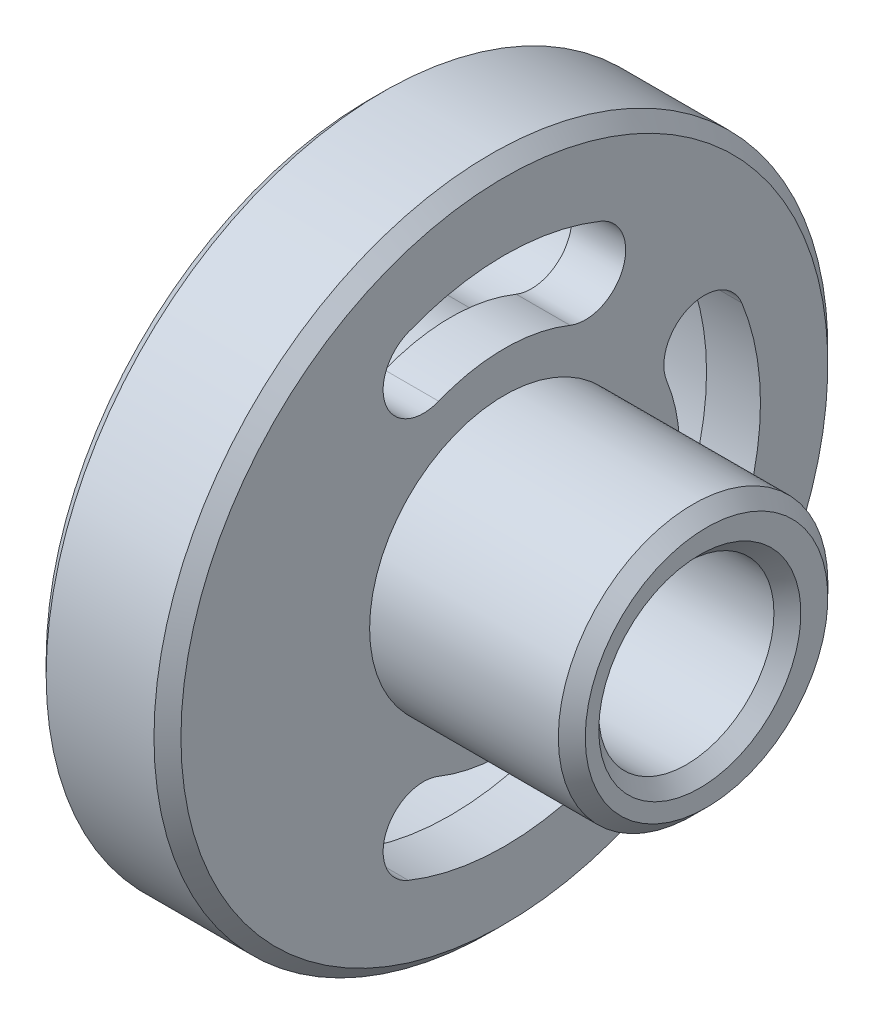
ISO-10303-21;
HEADER;
FILE_DESCRIPTION(('STEP AP214'),'2;1');
FILE_NAME('part.step','',(''),(''),'','','');
FILE_SCHEMA(('AUTOMOTIVE_DESIGN { 1 0 10303 214 1 1 1 1 }'));
ENDSEC;
DATA;
#1=APPLICATION_CONTEXT('core data for automotive mechanical design processes');
#2=APPLICATION_PROTOCOL_DEFINITION('international standard','automotive_design',2000,#1);
#3=PRODUCT_CONTEXT('',#1,'mechanical');
#4=PRODUCT('Part','Part','',(#3));
#5=PRODUCT_RELATED_PRODUCT_CATEGORY('part','',(#4));
#6=PRODUCT_DEFINITION_FORMATION('','',#4);
#7=PRODUCT_DEFINITION_CONTEXT('part definition',#1,'design');
#8=PRODUCT_DEFINITION('design','',#6,#7);
#9=PRODUCT_DEFINITION_SHAPE('','',#8);
#10=(LENGTH_UNIT() NAMED_UNIT(*) SI_UNIT(.MILLI.,.METRE.));
#11=(NAMED_UNIT(*) PLANE_ANGLE_UNIT() SI_UNIT($,.RADIAN.));
#12=(NAMED_UNIT(*) SI_UNIT($,.STERADIAN.) SOLID_ANGLE_UNIT());
#13=UNCERTAINTY_MEASURE_WITH_UNIT(LENGTH_MEASURE(1.E-05),#10,'distance_accuracy_value','');
#14=(GEOMETRIC_REPRESENTATION_CONTEXT(3) GLOBAL_UNCERTAINTY_ASSIGNED_CONTEXT((#13)) GLOBAL_UNIT_ASSIGNED_CONTEXT((#10,
#11,#12)) REPRESENTATION_CONTEXT('',''));
#15=CARTESIAN_POINT('',(0.,0.,0.));
#16=DIRECTION('',(0.,0.,1.));
#17=DIRECTION('',(1.,0.,0.));
#18=AXIS2_PLACEMENT_3D('',#15,#16,#17);
#19=CARTESIAN_POINT('',(0.,0.,0.));
#20=DIRECTION('',(1.,0.,0.));
#21=DIRECTION('',(0.,0.,-1.));
#22=AXIS2_PLACEMENT_3D('',#19,#20,#21);
#23=PLANE('',#22);
#24=CARTESIAN_POINT('',(0.,-6.00000000000006,-14.8323969741913));
#25=DIRECTION('',(-1.,0.,0.));
#26=DIRECTION('',(0.,0.,1.));
#27=AXIS2_PLACEMENT_3D('',#24,#25,#26);
#28=CIRCLE('',#27,5.);
#29=CARTESIAN_POINT('',(0.,-7.87500000000007,-19.4675210286261));
#30=VERTEX_POINT('',#29);
#31=CARTESIAN_POINT('',(0.,-4.12500000000004,-10.1972729197565));
#32=VERTEX_POINT('',#31);
#33=EDGE_CURVE('E343',#30,#32,#28,.T.);
#34=ORIENTED_EDGE('',*,*,#33,.F.);
#35=CARTESIAN_POINT('',(0.,0.,0.));
#36=DIRECTION('',(-1.,0.,0.));
#37=DIRECTION('',(0.,0.,1.));
#38=AXIS2_PLACEMENT_3D('',#35,#36,#37);
#39=CIRCLE('',#38,21.);
#40=CARTESIAN_POINT('',(0.,7.87499999999992,-19.4675210286261));
#41=VERTEX_POINT('',#40);
#42=EDGE_CURVE('E347',#41,#30,#39,.T.);
#43=ORIENTED_EDGE('',*,*,#42,.F.);
#44=CARTESIAN_POINT('',(0.,5.99999999999994,-14.8323969741913));
#45=DIRECTION('',(-1.,0.,0.));
#46=DIRECTION('',(0.,0.,1.));
#47=AXIS2_PLACEMENT_3D('',#44,#45,#46);
#48=CIRCLE('',#47,5.);
#49=CARTESIAN_POINT('',(0.,4.12499999999996,-10.1972729197565));
#50=VERTEX_POINT('',#49);
#51=EDGE_CURVE('E334',#50,#41,#48,.T.);
#52=ORIENTED_EDGE('',*,*,#51,.F.);
#53=CARTESIAN_POINT('',(0.,0.,0.));
#54=DIRECTION('',(1.,0.,0.));
#55=DIRECTION('',(0.,0.,1.));
#56=AXIS2_PLACEMENT_3D('',#53,#54,#55);
#57=CIRCLE('',#56,11.);
#58=EDGE_CURVE('E338',#32,#50,#57,.T.);
#59=ORIENTED_EDGE('',*,*,#58,.F.);
#60=EDGE_LOOP('',(#34,#43,#52,#59));
#61=FACE_BOUND('',#60,.T.);
#62=CARTESIAN_POINT('',(0.,-14.8323969741913,6.00000000000011));
#63=DIRECTION('',(-1.,0.,0.));
#64=DIRECTION('',(0.,0.,1.));
#65=AXIS2_PLACEMENT_3D('',#62,#63,#64);
#66=CIRCLE('',#65,5.);
#67=CARTESIAN_POINT('',(0.,-19.4675210286261,7.87500000000014));
#68=VERTEX_POINT('',#67);
#69=CARTESIAN_POINT('',(0.,-10.1972729197565,4.12500000000007));
#70=VERTEX_POINT('',#69);
#71=EDGE_CURVE('E299',#68,#70,#66,.T.);
#72=ORIENTED_EDGE('',*,*,#71,.F.);
#73=CARTESIAN_POINT('',(0.,0.,0.));
#74=DIRECTION('',(-1.,0.,0.));
#75=DIRECTION('',(0.,0.,1.));
#76=AXIS2_PLACEMENT_3D('',#73,#74,#75);
#77=CIRCLE('',#76,21.);
#78=CARTESIAN_POINT('',(0.,-19.4675210286262,-7.87499999999986));
#79=VERTEX_POINT('',#78);
#80=EDGE_CURVE('E303',#79,#68,#77,.T.);
#81=ORIENTED_EDGE('',*,*,#80,.F.);
#82=CARTESIAN_POINT('',(0.,-14.8323969741914,-5.99999999999989));
#83=DIRECTION('',(-1.,0.,0.));
#84=DIRECTION('',(0.,0.,1.));
#85=AXIS2_PLACEMENT_3D('',#82,#83,#84);
#86=CIRCLE('',#85,5.);
#87=CARTESIAN_POINT('',(0.,-10.1972729197566,-4.12499999999993));
#88=VERTEX_POINT('',#87);
#89=EDGE_CURVE('E290',#88,#79,#86,.T.);
#90=ORIENTED_EDGE('',*,*,#89,.F.);
#91=CARTESIAN_POINT('',(0.,0.,0.));
#92=DIRECTION('',(1.,0.,0.));
#93=DIRECTION('',(0.,0.,1.));
#94=AXIS2_PLACEMENT_3D('',#91,#92,#93);
#95=CIRCLE('',#94,11.);
#96=EDGE_CURVE('E294',#70,#88,#95,.T.);
#97=ORIENTED_EDGE('',*,*,#96,.F.);
#98=EDGE_LOOP('',(#72,#81,#90,#97));
#99=FACE_BOUND('',#98,.T.);
#100=CARTESIAN_POINT('',(0.,0.,0.));
#101=DIRECTION('',(-1.,0.,0.));
#102=DIRECTION('',(0.,0.,1.));
#103=AXIS2_PLACEMENT_3D('',#100,#101,#102);
#104=CIRCLE('',#103,21.);
#105=CARTESIAN_POINT('',(0.,19.4675210286261,7.875));
#106=VERTEX_POINT('',#105);
#107=CARTESIAN_POINT('',(0.,19.4675210286261,-7.875));
#108=VERTEX_POINT('',#107);
#109=EDGE_CURVE('E385',#106,#108,#104,.T.);
#110=ORIENTED_EDGE('',*,*,#109,.F.);
#111=CARTESIAN_POINT('',(0.,14.8323969741913,6.));
#112=DIRECTION('',(-1.,0.,0.));
#113=DIRECTION('',(0.,0.,1.));
#114=AXIS2_PLACEMENT_3D('',#111,#112,#113);
#115=CIRCLE('',#114,5.);
#116=CARTESIAN_POINT('',(0.,10.1972729197565,4.125));
#117=VERTEX_POINT('',#116);
#118=EDGE_CURVE('E350',#117,#106,#115,.T.);
#119=ORIENTED_EDGE('',*,*,#118,.F.);
#120=CARTESIAN_POINT('',(0.,0.,0.));
#121=DIRECTION('',(1.,0.,0.));
#122=DIRECTION('',(0.,0.,1.));
#123=AXIS2_PLACEMENT_3D('',#120,#121,#122);
#124=CIRCLE('',#123,11.);
#125=CARTESIAN_POINT('',(0.,10.1972729197565,-4.125));
#126=VERTEX_POINT('',#125);
#127=EDGE_CURVE('E370',#126,#117,#124,.T.);
#128=ORIENTED_EDGE('',*,*,#127,.F.);
#129=CARTESIAN_POINT('',(0.,14.8323969741913,-6.));
#130=DIRECTION('',(-1.,0.,0.));
#131=DIRECTION('',(0.,0.,1.));
#132=AXIS2_PLACEMENT_3D('',#129,#130,#131);
#133=CIRCLE('',#132,5.);
#134=EDGE_CURVE('E389',#108,#126,#133,.T.);
#135=ORIENTED_EDGE('',*,*,#134,.F.);
#136=EDGE_LOOP('',(#110,#119,#128,#135));
#137=FACE_BOUND('',#136,.T.);
#138=CARTESIAN_POINT('',(0.,0.,0.));
#139=DIRECTION('',(-1.,0.,0.));
#140=DIRECTION('',(0.,0.,1.));
#141=AXIS2_PLACEMENT_3D('',#138,#139,#140);
#142=CIRCLE('',#141,24.);
#143=CARTESIAN_POINT('',(0.,0.,24.));
#144=VERTEX_POINT('',#143);
#145=EDGE_CURVE('E432',#144,#144,#142,.T.);
#146=ORIENTED_EDGE('',*,*,#145,.T.);
#147=EDGE_LOOP('',(#146));
#148=FACE_BOUND('',#147,.T.);
#149=ADVANCED_FACE('F50',(#61,#99,#137,#148),#23,.F.);
#150=CARTESIAN_POINT('',(1.,0.,0.));
#151=DIRECTION('',(1.,0.,0.));
#152=DIRECTION('',(0.,0.,-1.));
#153=AXIS2_PLACEMENT_3D('',#150,#151,#152);
#154=CONICAL_SURFACE('',#153,25.,0.785398163397449);
#155=ORIENTED_EDGE('',*,*,#145,.F.);
#156=EDGE_LOOP('',(#155));
#157=FACE_BOUND('',#156,.T.);
#158=CARTESIAN_POINT('',(1.,0.,0.));
#159=DIRECTION('',(-1.,0.,0.));
#160=DIRECTION('',(0.,0.,1.));
#161=AXIS2_PLACEMENT_3D('',#158,#159,#160);
#162=CIRCLE('',#161,25.);
#163=CARTESIAN_POINT('',(1.,0.,25.));
#164=VERTEX_POINT('',#163);
#165=EDGE_CURVE('E428',#164,#164,#162,.T.);
#166=ORIENTED_EDGE('',*,*,#165,.T.);
#167=EDGE_LOOP('',(#166));
#168=FACE_BOUND('',#167,.T.);
#169=ADVANCED_FACE('F490',(#157,#168),#154,.T.);
#170=CARTESIAN_POINT('',(0.,0.,0.));
#171=DIRECTION('',(-1.,0.,0.));
#172=DIRECTION('',(0.,0.,1.));
#173=AXIS2_PLACEMENT_3D('',#170,#171,#172);
#174=CYLINDRICAL_SURFACE('',#173,25.);
#175=ORIENTED_EDGE('',*,*,#165,.F.);
#176=EDGE_LOOP('',(#175));
#177=FACE_BOUND('',#176,.T.);
#178=CARTESIAN_POINT('',(9.,0.,0.));
#179=DIRECTION('',(-1.,0.,0.));
#180=DIRECTION('',(0.,0.,1.));
#181=AXIS2_PLACEMENT_3D('',#178,#179,#180);
#182=CIRCLE('',#181,25.);
#183=CARTESIAN_POINT('',(9.,0.,25.));
#184=VERTEX_POINT('',#183);
#185=EDGE_CURVE('E424',#184,#184,#182,.T.);
#186=ORIENTED_EDGE('',*,*,#185,.T.);
#187=EDGE_LOOP('',(#186));
#188=FACE_BOUND('',#187,.T.);
#189=ADVANCED_FACE('F497',(#177,#188),#174,.T.);
#190=CARTESIAN_POINT('',(10.,0.,0.));
#191=DIRECTION('',(-1.,0.,0.));
#192=DIRECTION('',(0.,0.,1.));
#193=AXIS2_PLACEMENT_3D('',#190,#191,#192);
#194=CONICAL_SURFACE('',#193,24.,0.785398163397449);
#195=ORIENTED_EDGE('',*,*,#185,.F.);
#196=EDGE_LOOP('',(#195));
#197=FACE_BOUND('',#196,.T.);
#198=CARTESIAN_POINT('',(10.,0.,0.));
#199=DIRECTION('',(-1.,0.,0.));
#200=DIRECTION('',(0.,0.,1.));
#201=AXIS2_PLACEMENT_3D('',#198,#199,#200);
#202=CIRCLE('',#201,24.);
#203=CARTESIAN_POINT('',(10.,0.,24.));
#204=VERTEX_POINT('',#203);
#205=EDGE_CURVE('E420',#204,#204,#202,.T.);
#206=ORIENTED_EDGE('',*,*,#205,.T.);
#207=EDGE_LOOP('',(#206));
#208=FACE_BOUND('',#207,.T.);
#209=ADVANCED_FACE('F505',(#197,#208),#194,.T.);
#210=CARTESIAN_POINT('',(10.,24.,0.));
#211=DIRECTION('',(-1.,0.,0.));
#212=DIRECTION('',(0.,0.,1.));
#213=AXIS2_PLACEMENT_3D('',#210,#211,#212);
#214=PLANE('',#213);
#215=CARTESIAN_POINT('',(10.,0.,0.));
#216=DIRECTION('',(-1.,0.,0.));
#217=DIRECTION('',(0.,0.,1.));
#218=AXIS2_PLACEMENT_3D('',#215,#216,#217);
#219=CIRCLE('',#218,13.);
#220=CARTESIAN_POINT('',(10.,12.0513225415304,-4.875));
#221=VERTEX_POINT('',#220);
#222=CARTESIAN_POINT('',(10.,12.0513225415305,4.875));
#223=VERTEX_POINT('',#222);
#224=EDGE_CURVE('E268',#221,#223,#219,.F.);
#225=ORIENTED_EDGE('',*,*,#224,.T.);
#226=CARTESIAN_POINT('',(10.,14.8323969741913,5.99999999999999));
#227=DIRECTION('',(-1.,0.,0.));
#228=DIRECTION('',(0.,0.,1.));
#229=AXIS2_PLACEMENT_3D('',#226,#227,#228);
#230=CIRCLE('',#229,3.);
#231=CARTESIAN_POINT('',(10.,17.6134714068522,7.125));
#232=VERTEX_POINT('',#231);
#233=EDGE_CURVE('E272',#223,#232,#230,.T.);
#234=ORIENTED_EDGE('',*,*,#233,.T.);
#235=CARTESIAN_POINT('',(10.,0.,0.));
#236=DIRECTION('',(-1.,0.,0.));
#237=DIRECTION('',(0.,0.,1.));
#238=AXIS2_PLACEMENT_3D('',#235,#236,#237);
#239=CIRCLE('',#238,19.);
#240=CARTESIAN_POINT('',(10.,17.6134714068522,-7.125));
#241=VERTEX_POINT('',#240);
#242=EDGE_CURVE('E260',#232,#241,#239,.T.);
#243=ORIENTED_EDGE('',*,*,#242,.T.);
#244=CARTESIAN_POINT('',(10.,14.8323969741913,-6.));
#245=DIRECTION('',(-1.,0.,0.));
#246=DIRECTION('',(0.,0.,1.));
#247=AXIS2_PLACEMENT_3D('',#244,#245,#246);
#248=CIRCLE('',#247,3.);
#249=EDGE_CURVE('E264',#241,#221,#248,.T.);
#250=ORIENTED_EDGE('',*,*,#249,.T.);
#251=EDGE_LOOP('',(#225,#234,#243,#250));
#252=FACE_BOUND('',#251,.T.);
#253=CARTESIAN_POINT('',(10.,6.00000000000054,-14.8323969741911));
#254=DIRECTION('',(-1.,0.,0.));
#255=DIRECTION('',(0.,0.,1.));
#256=AXIS2_PLACEMENT_3D('',#253,#254,#255);
#257=CIRCLE('',#256,3.);
#258=CARTESIAN_POINT('',(10.,4.87500000000044,-12.0513225415303));
#259=VERTEX_POINT('',#258);
#260=CARTESIAN_POINT('',(10.,7.12500000000065,-17.6134714068519));
#261=VERTEX_POINT('',#260);
#262=EDGE_CURVE('E237',#259,#261,#257,.T.);
#263=ORIENTED_EDGE('',*,*,#262,.T.);
#264=CARTESIAN_POINT('',(10.,0.,0.));
#265=DIRECTION('',(-1.,0.,0.));
#266=DIRECTION('',(0.,0.,1.));
#267=AXIS2_PLACEMENT_3D('',#264,#265,#266);
#268=CIRCLE('',#267,19.);
#269=CARTESIAN_POINT('',(10.,-7.12499999999935,-17.6134714068525));
#270=VERTEX_POINT('',#269);
#271=EDGE_CURVE('E226',#261,#270,#268,.T.);
#272=ORIENTED_EDGE('',*,*,#271,.T.);
#273=CARTESIAN_POINT('',(10.,-5.99999999999946,-14.8323969741915));
#274=DIRECTION('',(-1.,0.,0.));
#275=DIRECTION('',(0.,0.,1.));
#276=AXIS2_PLACEMENT_3D('',#273,#274,#275);
#277=CIRCLE('',#276,3.);
#278=CARTESIAN_POINT('',(10.,-4.87499999999955,-12.0513225415306));
#279=VERTEX_POINT('',#278);
#280=EDGE_CURVE('E211',#270,#279,#277,.T.);
#281=ORIENTED_EDGE('',*,*,#280,.T.);
#282=CARTESIAN_POINT('',(10.,0.,0.));
#283=DIRECTION('',(-1.,0.,0.));
#284=DIRECTION('',(0.,0.,1.));
#285=AXIS2_PLACEMENT_3D('',#282,#283,#284);
#286=CIRCLE('',#285,13.);
#287=EDGE_CURVE('E220',#279,#259,#286,.F.);
#288=ORIENTED_EDGE('',*,*,#287,.T.);
#289=EDGE_LOOP('',(#263,#272,#281,#288));
#290=FACE_BOUND('',#289,.T.);
#291=CARTESIAN_POINT('',(10.,-14.8323969741909,-6.00000000000109));
#292=DIRECTION('',(-1.,0.,0.));
#293=DIRECTION('',(0.,0.,1.));
#294=AXIS2_PLACEMENT_3D('',#291,#292,#293);
#295=CIRCLE('',#294,3.);
#296=CARTESIAN_POINT('',(10.,-12.0513225415301,-4.87500000000089));
#297=VERTEX_POINT('',#296);
#298=CARTESIAN_POINT('',(10.,-17.6134714068517,-7.1250000000013));
#299=VERTEX_POINT('',#298);
#300=EDGE_CURVE('E252',#297,#299,#295,.T.);
#301=ORIENTED_EDGE('',*,*,#300,.T.);
#302=CARTESIAN_POINT('',(10.,0.,0.));
#303=DIRECTION('',(-1.,0.,0.));
#304=DIRECTION('',(0.,0.,1.));
#305=AXIS2_PLACEMENT_3D('',#302,#303,#304);
#306=CIRCLE('',#305,19.);
#307=CARTESIAN_POINT('',(10.,-17.6134714068527,7.1249999999987));
#308=VERTEX_POINT('',#307);
#309=EDGE_CURVE('E256',#299,#308,#306,.T.);
#310=ORIENTED_EDGE('',*,*,#309,.T.);
#311=CARTESIAN_POINT('',(10.,-14.8323969741918,5.99999999999891));
#312=DIRECTION('',(-1.,0.,0.));
#313=DIRECTION('',(0.,0.,1.));
#314=AXIS2_PLACEMENT_3D('',#311,#312,#313);
#315=CIRCLE('',#314,3.);
#316=CARTESIAN_POINT('',(10.,-12.0513225415308,4.87499999999911));
#317=VERTEX_POINT('',#316);
#318=EDGE_CURVE('E239',#308,#317,#315,.T.);
#319=ORIENTED_EDGE('',*,*,#318,.T.);
#320=CARTESIAN_POINT('',(10.,0.,0.));
#321=DIRECTION('',(-1.,0.,0.));
#322=DIRECTION('',(0.,0.,1.));
#323=AXIS2_PLACEMENT_3D('',#320,#321,#322);
#324=CIRCLE('',#323,13.);
#325=EDGE_CURVE('E244',#317,#297,#324,.F.);
#326=ORIENTED_EDGE('',*,*,#325,.T.);
#327=EDGE_LOOP('',(#301,#310,#319,#326));
#328=FACE_BOUND('',#327,.T.);
#329=ORIENTED_EDGE('',*,*,#205,.F.);
#330=EDGE_LOOP('',(#329));
#331=FACE_BOUND('',#330,.T.);
#332=CARTESIAN_POINT('',(10.,0.,0.));
#333=DIRECTION('',(-1.,0.,0.));
#334=DIRECTION('',(0.,0.,1.));
#335=AXIS2_PLACEMENT_3D('',#332,#333,#334);
#336=CIRCLE('',#335,10.);
#337=CARTESIAN_POINT('',(10.,0.,10.));
#338=VERTEX_POINT('',#337);
#339=EDGE_CURVE('E416',#338,#338,#336,.T.);
#340=ORIENTED_EDGE('',*,*,#339,.T.);
#341=EDGE_LOOP('',(#340));
#342=FACE_BOUND('',#341,.T.);
#343=ADVANCED_FACE('F235',(#252,#290,#328,#331,#342),#214,.F.);
#344=CARTESIAN_POINT('',(0.,0.,0.));
#345=DIRECTION('',(-1.,0.,0.));
#346=DIRECTION('',(0.,0.,1.));
#347=AXIS2_PLACEMENT_3D('',#344,#345,#346);
#348=CYLINDRICAL_SURFACE('',#347,10.);
#349=ORIENTED_EDGE('',*,*,#339,.F.);
#350=EDGE_LOOP('',(#349));
#351=FACE_BOUND('',#350,.T.);
#352=CARTESIAN_POINT('',(24.,0.,0.));
#353=DIRECTION('',(-1.,0.,0.));
#354=DIRECTION('',(0.,0.,1.));
#355=AXIS2_PLACEMENT_3D('',#352,#353,#354);
#356=CIRCLE('',#355,10.);
#357=CARTESIAN_POINT('',(24.,0.,10.));
#358=VERTEX_POINT('',#357);
#359=EDGE_CURVE('E412',#358,#358,#356,.T.);
#360=ORIENTED_EDGE('',*,*,#359,.T.);
#361=EDGE_LOOP('',(#360));
#362=FACE_BOUND('',#361,.T.);
#363=ADVANCED_FACE('F512',(#351,#362),#348,.T.);
#364=CARTESIAN_POINT('',(25.,0.,0.));
#365=DIRECTION('',(-1.,0.,0.));
#366=DIRECTION('',(0.,0.,1.));
#367=AXIS2_PLACEMENT_3D('',#364,#365,#366);
#368=CONICAL_SURFACE('',#367,9.,0.785398163397447);
#369=ORIENTED_EDGE('',*,*,#359,.F.);
#370=EDGE_LOOP('',(#369));
#371=FACE_BOUND('',#370,.T.);
#372=CARTESIAN_POINT('',(25.,0.,0.));
#373=DIRECTION('',(-1.,0.,0.));
#374=DIRECTION('',(0.,0.,1.));
#375=AXIS2_PLACEMENT_3D('',#372,#373,#374);
#376=CIRCLE('',#375,9.);
#377=CARTESIAN_POINT('',(25.,0.,9.));
#378=VERTEX_POINT('',#377);
#379=EDGE_CURVE('E399',#378,#378,#376,.T.);
#380=ORIENTED_EDGE('',*,*,#379,.T.);
#381=EDGE_LOOP('',(#380));
#382=FACE_BOUND('',#381,.T.);
#383=ADVANCED_FACE('F516',(#371,#382),#368,.T.);
#384=CARTESIAN_POINT('',(25.,9.,0.));
#385=DIRECTION('',(-1.,0.,0.));
#386=DIRECTION('',(0.,0.,1.));
#387=AXIS2_PLACEMENT_3D('',#384,#385,#386);
#388=PLANE('',#387);
#389=CARTESIAN_POINT('',(25.,0.,0.5));
#390=DIRECTION('',(-1.,0.,0.));
#391=DIRECTION('',(0.,0.,1.));
#392=AXIS2_PLACEMENT_3D('',#389,#390,#391);
#393=CIRCLE('',#392,7.50000000000001);
#394=CARTESIAN_POINT('',(25.,0.,8.00000000000001));
#395=VERTEX_POINT('',#394);
#396=EDGE_CURVE('E11',#395,#395,#393,.T.);
#397=ORIENTED_EDGE('',*,*,#396,.T.);
#398=EDGE_LOOP('',(#397));
#399=FACE_BOUND('',#398,.T.);
#400=ORIENTED_EDGE('',*,*,#379,.F.);
#401=EDGE_LOOP('',(#400));
#402=FACE_BOUND('',#401,.T.);
#403=ADVANCED_FACE('F519',(#399,#402),#388,.F.);
#404=CARTESIAN_POINT('',(6.,14.8323969741913,6.));
#405=DIRECTION('',(-1.,0.,0.));
#406=DIRECTION('',(0.,0.,1.));
#407=AXIS2_PLACEMENT_3D('',#404,#405,#406);
#408=CYLINDRICAL_SURFACE('',#407,5.);
#409=ORIENTED_EDGE('',*,*,#118,.T.);
#410=DIRECTION('',(-1.,0.,0.));
#411=VECTOR('',#410,1.);
#412=CARTESIAN_POINT('',(6.,19.4675210286261,7.875));
#413=LINE('',#412,#411);
#414=CARTESIAN_POINT('',(6.,19.4675210286261,7.875));
#415=VERTEX_POINT('',#414);
#416=EDGE_CURVE('E382',#415,#106,#413,.T.);
#417=ORIENTED_EDGE('',*,*,#416,.F.);
#418=CARTESIAN_POINT('',(6.,14.8323969741913,6.));
#419=DIRECTION('',(-1.,0.,0.));
#420=DIRECTION('',(0.,0.,1.));
#421=AXIS2_PLACEMENT_3D('',#418,#419,#420);
#422=CIRCLE('',#421,5.);
#423=CARTESIAN_POINT('',(6.,10.1972729197565,4.125));
#424=VERTEX_POINT('',#423);
#425=EDGE_CURVE('E365',#424,#415,#422,.T.);
#426=ORIENTED_EDGE('',*,*,#425,.F.);
#427=DIRECTION('',(-1.,0.,0.));
#428=VECTOR('',#427,1.);
#429=CARTESIAN_POINT('',(6.,10.1972729197565,4.125));
#430=LINE('',#429,#428);
#431=EDGE_CURVE('E396',#424,#117,#430,.T.);
#432=ORIENTED_EDGE('',*,*,#431,.T.);
#433=EDGE_LOOP('',(#409,#417,#426,#432));
#434=FACE_BOUND('',#433,.T.);
#435=ADVANCED_FACE('F523',(#434),#408,.F.);
#436=CARTESIAN_POINT('',(6.,0.,0.));
#437=DIRECTION('',(-1.,0.,0.));
#438=DIRECTION('',(0.,0.,1.));
#439=AXIS2_PLACEMENT_3D('',#436,#437,#438);
#440=CYLINDRICAL_SURFACE('',#439,11.);
#441=ORIENTED_EDGE('',*,*,#127,.T.);
#442=ORIENTED_EDGE('',*,*,#431,.F.);
#443=CARTESIAN_POINT('',(6.,0.,0.));
#444=DIRECTION('',(1.,0.,0.));
#445=DIRECTION('',(0.,0.,1.));
#446=AXIS2_PLACEMENT_3D('',#443,#444,#445);
#447=CIRCLE('',#446,11.);
#448=CARTESIAN_POINT('',(6.,10.1972729197565,-4.125));
#449=VERTEX_POINT('',#448);
#450=EDGE_CURVE('E378',#449,#424,#447,.T.);
#451=ORIENTED_EDGE('',*,*,#450,.F.);
#452=DIRECTION('',(-1.,0.,0.));
#453=VECTOR('',#452,1.);
#454=CARTESIAN_POINT('',(6.,10.1972729197565,-4.125));
#455=LINE('',#454,#453);
#456=EDGE_CURVE('E400',#449,#126,#455,.T.);
#457=ORIENTED_EDGE('',*,*,#456,.T.);
#458=EDGE_LOOP('',(#441,#442,#451,#457));
#459=FACE_BOUND('',#458,.T.);
#460=ADVANCED_FACE('F526',(#459),#440,.T.);
#461=CARTESIAN_POINT('',(6.,14.8323969741913,-6.));
#462=DIRECTION('',(-1.,0.,0.));
#463=DIRECTION('',(0.,0.,1.));
#464=AXIS2_PLACEMENT_3D('',#461,#462,#463);
#465=CYLINDRICAL_SURFACE('',#464,5.);
#466=ORIENTED_EDGE('',*,*,#134,.T.);
#467=ORIENTED_EDGE('',*,*,#456,.F.);
#468=CARTESIAN_POINT('',(6.,14.8323969741913,-6.));
#469=DIRECTION('',(-1.,0.,0.));
#470=DIRECTION('',(0.,0.,1.));
#471=AXIS2_PLACEMENT_3D('',#468,#469,#470);
#472=CIRCLE('',#471,5.);
#473=CARTESIAN_POINT('',(6.,19.4675210286261,-7.875));
#474=VERTEX_POINT('',#473);
#475=EDGE_CURVE('E374',#474,#449,#472,.T.);
#476=ORIENTED_EDGE('',*,*,#475,.F.);
#477=DIRECTION('',(-1.,0.,0.));
#478=VECTOR('',#477,1.);
#479=CARTESIAN_POINT('',(6.,19.4675210286261,-7.875));
#480=LINE('',#479,#478);
#481=EDGE_CURVE('E403',#474,#108,#480,.T.);
#482=ORIENTED_EDGE('',*,*,#481,.T.);
#483=EDGE_LOOP('',(#466,#467,#476,#482));
#484=FACE_BOUND('',#483,.T.);
#485=ADVANCED_FACE('F532',(#484),#465,.F.);
#486=CARTESIAN_POINT('',(6.,0.,0.));
#487=DIRECTION('',(-1.,0.,0.));
#488=DIRECTION('',(0.,0.,1.));
#489=AXIS2_PLACEMENT_3D('',#486,#487,#488);
#490=CYLINDRICAL_SURFACE('',#489,21.);
#491=ORIENTED_EDGE('',*,*,#109,.T.);
#492=ORIENTED_EDGE('',*,*,#481,.F.);
#493=CARTESIAN_POINT('',(6.,0.,0.));
#494=DIRECTION('',(-1.,0.,0.));
#495=DIRECTION('',(0.,0.,1.));
#496=AXIS2_PLACEMENT_3D('',#493,#494,#495);
#497=CIRCLE('',#496,21.);
#498=EDGE_CURVE('E369',#415,#474,#497,.T.);
#499=ORIENTED_EDGE('',*,*,#498,.F.);
#500=ORIENTED_EDGE('',*,*,#416,.T.);
#501=EDGE_LOOP('',(#491,#492,#499,#500));
#502=FACE_BOUND('',#501,.T.);
#503=ADVANCED_FACE('F528',(#502),#490,.F.);
#504=CARTESIAN_POINT('',(6.,7.41619848709566,3.));
#505=DIRECTION('',(-1.,0.,0.));
#506=DIRECTION('',(0.,0.,1.));
#507=AXIS2_PLACEMENT_3D('',#504,#505,#506);
#508=PLANE('',#507);
#509=CARTESIAN_POINT('',(6.,14.8323969741913,5.99999999999999));
#510=DIRECTION('',(-1.,0.,0.));
#511=DIRECTION('',(0.,0.,1.));
#512=AXIS2_PLACEMENT_3D('',#509,#510,#511);
#513=CIRCLE('',#512,3.);
#514=CARTESIAN_POINT('',(6.,12.0513225415305,4.875));
#515=VERTEX_POINT('',#514);
#516=CARTESIAN_POINT('',(6.,17.6134714068522,7.125));
#517=VERTEX_POINT('',#516);
#518=EDGE_CURVE('E469',#515,#517,#513,.T.);
#519=ORIENTED_EDGE('',*,*,#518,.F.);
#520=CARTESIAN_POINT('',(6.,0.,0.));
#521=DIRECTION('',(-1.,0.,0.));
#522=DIRECTION('',(0.,0.,1.));
#523=AXIS2_PLACEMENT_3D('',#520,#521,#522);
#524=CIRCLE('',#523,13.);
#525=CARTESIAN_POINT('',(6.,12.0513225415304,-4.875));
#526=VERTEX_POINT('',#525);
#527=EDGE_CURVE('E466',#526,#515,#524,.F.);
#528=ORIENTED_EDGE('',*,*,#527,.F.);
#529=CARTESIAN_POINT('',(6.,14.8323969741913,-6.));
#530=DIRECTION('',(-1.,0.,0.));
#531=DIRECTION('',(0.,0.,1.));
#532=AXIS2_PLACEMENT_3D('',#529,#530,#531);
#533=CIRCLE('',#532,3.);
#534=CARTESIAN_POINT('',(6.,17.6134714068522,-7.125));
#535=VERTEX_POINT('',#534);
#536=EDGE_CURVE('E463',#535,#526,#533,.T.);
#537=ORIENTED_EDGE('',*,*,#536,.F.);
#538=CARTESIAN_POINT('',(6.,0.,0.));
#539=DIRECTION('',(-1.,0.,0.));
#540=DIRECTION('',(0.,0.,1.));
#541=AXIS2_PLACEMENT_3D('',#538,#539,#540);
#542=CIRCLE('',#541,19.);
#543=EDGE_CURVE('E460',#517,#535,#542,.T.);
#544=ORIENTED_EDGE('',*,*,#543,.F.);
#545=EDGE_LOOP('',(#519,#528,#537,#544));
#546=FACE_BOUND('',#545,.T.);
#547=ORIENTED_EDGE('',*,*,#425,.T.);
#548=ORIENTED_EDGE('',*,*,#498,.T.);
#549=ORIENTED_EDGE('',*,*,#475,.T.);
#550=ORIENTED_EDGE('',*,*,#450,.T.);
#551=EDGE_LOOP('',(#547,#548,#549,#550));
#552=FACE_BOUND('',#551,.T.);
#553=ADVANCED_FACE('F531',(#546,#552),#508,.T.);
#554=CARTESIAN_POINT('',(6.,0.,0.));
#555=DIRECTION('',(-1.,0.,0.));
#556=DIRECTION('',(0.,0.,1.));
#557=AXIS2_PLACEMENT_3D('',#554,#555,#556);
#558=CYLINDRICAL_SURFACE('',#557,21.);
#559=ORIENTED_EDGE('',*,*,#80,.T.);
#560=DIRECTION('',(-1.,0.,0.));
#561=VECTOR('',#560,1.);
#562=CARTESIAN_POINT('',(6.,-19.4675210286261,7.87500000000014));
#563=LINE('',#562,#561);
#564=CARTESIAN_POINT('',(6.,-19.4675210286261,7.87500000000014));
#565=VERTEX_POINT('',#564);
#566=EDGE_CURVE('E277',#565,#68,#563,.T.);
#567=ORIENTED_EDGE('',*,*,#566,.F.);
#568=CARTESIAN_POINT('',(6.,0.,0.));
#569=DIRECTION('',(-1.,0.,0.));
#570=DIRECTION('',(0.,0.,1.));
#571=AXIS2_PLACEMENT_3D('',#568,#569,#570);
#572=CIRCLE('',#571,21.);
#573=CARTESIAN_POINT('',(6.,-19.4675210286262,-7.87499999999986));
#574=VERTEX_POINT('',#573);
#575=EDGE_CURVE('E295',#574,#565,#572,.T.);
#576=ORIENTED_EDGE('',*,*,#575,.F.);
#577=DIRECTION('',(-1.,0.,0.));
#578=VECTOR('',#577,1.);
#579=CARTESIAN_POINT('',(6.,-19.4675210286262,-7.87499999999986));
#580=LINE('',#579,#578);
#581=EDGE_CURVE('E276',#574,#79,#580,.T.);
#582=ORIENTED_EDGE('',*,*,#581,.T.);
#583=EDGE_LOOP('',(#559,#567,#576,#582));
#584=FACE_BOUND('',#583,.T.);
#585=ADVANCED_FACE('F542',(#584),#558,.F.);
#586=CARTESIAN_POINT('',(6.,-14.8323969741914,-5.99999999999989));
#587=DIRECTION('',(-1.,0.,0.));
#588=DIRECTION('',(0.,0.,1.));
#589=AXIS2_PLACEMENT_3D('',#586,#587,#588);
#590=CYLINDRICAL_SURFACE('',#589,5.);
#591=ORIENTED_EDGE('',*,*,#89,.T.);
#592=ORIENTED_EDGE('',*,*,#581,.F.);
#593=CARTESIAN_POINT('',(6.,-14.8323969741914,-5.99999999999989));
#594=DIRECTION('',(-1.,0.,0.));
#595=DIRECTION('',(0.,0.,1.));
#596=AXIS2_PLACEMENT_3D('',#593,#594,#595);
#597=CIRCLE('',#596,5.);
#598=CARTESIAN_POINT('',(6.,-10.1972729197566,-4.12499999999993));
#599=VERTEX_POINT('',#598);
#600=EDGE_CURVE('E281',#599,#574,#597,.T.);
#601=ORIENTED_EDGE('',*,*,#600,.F.);
#602=DIRECTION('',(-1.,0.,0.));
#603=VECTOR('',#602,1.);
#604=CARTESIAN_POINT('',(6.,-10.1972729197566,-4.12499999999993));
#605=LINE('',#604,#603);
#606=EDGE_CURVE('E285',#599,#88,#605,.T.);
#607=ORIENTED_EDGE('',*,*,#606,.T.);
#608=EDGE_LOOP('',(#591,#592,#601,#607));
#609=FACE_BOUND('',#608,.T.);
#610=ADVANCED_FACE('F569',(#609),#590,.F.);
#611=CARTESIAN_POINT('',(6.,0.,0.));
#612=DIRECTION('',(-1.,0.,0.));
#613=DIRECTION('',(0.,0.,1.));
#614=AXIS2_PLACEMENT_3D('',#611,#612,#613);
#615=CYLINDRICAL_SURFACE('',#614,11.);
#616=ORIENTED_EDGE('',*,*,#96,.T.);
#617=ORIENTED_EDGE('',*,*,#606,.F.);
#618=CARTESIAN_POINT('',(6.,0.,0.));
#619=DIRECTION('',(1.,0.,0.));
#620=DIRECTION('',(0.,0.,1.));
#621=AXIS2_PLACEMENT_3D('',#618,#619,#620);
#622=CIRCLE('',#621,11.);
#623=CARTESIAN_POINT('',(6.,-10.1972729197565,4.12500000000007));
#624=VERTEX_POINT('',#623);
#625=EDGE_CURVE('E310',#624,#599,#622,.T.);
#626=ORIENTED_EDGE('',*,*,#625,.F.);
#627=DIRECTION('',(-1.,0.,0.));
#628=VECTOR('',#627,1.);
#629=CARTESIAN_POINT('',(6.,-10.1972729197565,4.12500000000007));
#630=LINE('',#629,#628);
#631=EDGE_CURVE('E282',#624,#70,#630,.T.);
#632=ORIENTED_EDGE('',*,*,#631,.T.);
#633=EDGE_LOOP('',(#616,#617,#626,#632));
#634=FACE_BOUND('',#633,.T.);
#635=ADVANCED_FACE('F572',(#634),#615,.T.);
#636=CARTESIAN_POINT('',(6.,-14.8323969741913,6.00000000000011));
#637=DIRECTION('',(-1.,0.,0.));
#638=DIRECTION('',(0.,0.,1.));
#639=AXIS2_PLACEMENT_3D('',#636,#637,#638);
#640=CYLINDRICAL_SURFACE('',#639,5.);
#641=ORIENTED_EDGE('',*,*,#71,.T.);
#642=ORIENTED_EDGE('',*,*,#631,.F.);
#643=CARTESIAN_POINT('',(6.,-14.8323969741913,6.00000000000011));
#644=DIRECTION('',(-1.,0.,0.));
#645=DIRECTION('',(0.,0.,1.));
#646=AXIS2_PLACEMENT_3D('',#643,#644,#645);
#647=CIRCLE('',#646,5.);
#648=EDGE_CURVE('E314',#565,#624,#647,.T.);
#649=ORIENTED_EDGE('',*,*,#648,.F.);
#650=ORIENTED_EDGE('',*,*,#566,.T.);
#651=EDGE_LOOP('',(#641,#642,#649,#650));
#652=FACE_BOUND('',#651,.T.);
#653=ADVANCED_FACE('F567',(#652),#640,.F.);
#654=CARTESIAN_POINT('',(6.,-7.41619848709565,3.00000000000005));
#655=DIRECTION('',(-1.,0.,0.));
#656=DIRECTION('',(0.,0.,1.));
#657=AXIS2_PLACEMENT_3D('',#654,#655,#656);
#658=PLANE('',#657);
#659=CARTESIAN_POINT('',(6.,0.,0.));
#660=DIRECTION('',(-1.,0.,0.));
#661=DIRECTION('',(0.,0.,1.));
#662=AXIS2_PLACEMENT_3D('',#659,#660,#661);
#663=CIRCLE('',#662,19.);
#664=CARTESIAN_POINT('',(6.,-17.6134714068517,-7.1250000000013));
#665=VERTEX_POINT('',#664);
#666=CARTESIAN_POINT('',(6.,-17.6134714068527,7.1249999999987));
#667=VERTEX_POINT('',#666);
#668=EDGE_CURVE('E456',#665,#667,#663,.T.);
#669=ORIENTED_EDGE('',*,*,#668,.F.);
#670=CARTESIAN_POINT('',(6.,-14.8323969741909,-6.00000000000109));
#671=DIRECTION('',(-1.,0.,0.));
#672=DIRECTION('',(0.,0.,1.));
#673=AXIS2_PLACEMENT_3D('',#670,#671,#672);
#674=CIRCLE('',#673,3.);
#675=CARTESIAN_POINT('',(6.,-12.0513225415301,-4.87500000000089));
#676=VERTEX_POINT('',#675);
#677=EDGE_CURVE('E453',#676,#665,#674,.T.);
#678=ORIENTED_EDGE('',*,*,#677,.F.);
#679=CARTESIAN_POINT('',(6.,0.,0.));
#680=DIRECTION('',(-1.,0.,0.));
#681=DIRECTION('',(0.,0.,1.));
#682=AXIS2_PLACEMENT_3D('',#679,#680,#681);
#683=CIRCLE('',#682,13.);
#684=CARTESIAN_POINT('',(6.,-12.0513225415308,4.87499999999911));
#685=VERTEX_POINT('',#684);
#686=EDGE_CURVE('E450',#685,#676,#683,.F.);
#687=ORIENTED_EDGE('',*,*,#686,.F.);
#688=CARTESIAN_POINT('',(6.,-14.8323969741918,5.99999999999891));
#689=DIRECTION('',(-1.,0.,0.));
#690=DIRECTION('',(0.,0.,1.));
#691=AXIS2_PLACEMENT_3D('',#688,#689,#690);
#692=CIRCLE('',#691,3.);
#693=EDGE_CURVE('E447',#667,#685,#692,.T.);
#694=ORIENTED_EDGE('',*,*,#693,.F.);
#695=EDGE_LOOP('',(#669,#678,#687,#694));
#696=FACE_BOUND('',#695,.T.);
#697=ORIENTED_EDGE('',*,*,#575,.T.);
#698=ORIENTED_EDGE('',*,*,#648,.T.);
#699=ORIENTED_EDGE('',*,*,#625,.T.);
#700=ORIENTED_EDGE('',*,*,#600,.T.);
#701=EDGE_LOOP('',(#697,#698,#699,#700));
#702=FACE_BOUND('',#701,.T.);
#703=ADVANCED_FACE('F563',(#696,#702),#658,.T.);
#704=CARTESIAN_POINT('',(6.,0.,0.));
#705=DIRECTION('',(-1.,0.,0.));
#706=DIRECTION('',(0.,0.,1.));
#707=AXIS2_PLACEMENT_3D('',#704,#705,#706);
#708=CYLINDRICAL_SURFACE('',#707,21.);
#709=ORIENTED_EDGE('',*,*,#42,.T.);
#710=DIRECTION('',(-1.,0.,0.));
#711=VECTOR('',#710,1.);
#712=CARTESIAN_POINT('',(6.,-7.87500000000007,-19.4675210286261));
#713=LINE('',#712,#711);
#714=CARTESIAN_POINT('',(6.,-7.87500000000007,-19.4675210286261));
#715=VERTEX_POINT('',#714);
#716=EDGE_CURVE('E321',#715,#30,#713,.T.);
#717=ORIENTED_EDGE('',*,*,#716,.F.);
#718=CARTESIAN_POINT('',(6.,0.,0.));
#719=DIRECTION('',(-1.,0.,0.));
#720=DIRECTION('',(0.,0.,1.));
#721=AXIS2_PLACEMENT_3D('',#718,#719,#720);
#722=CIRCLE('',#721,21.);
#723=CARTESIAN_POINT('',(6.,7.87499999999992,-19.4675210286261));
#724=VERTEX_POINT('',#723);
#725=EDGE_CURVE('E339',#724,#715,#722,.T.);
#726=ORIENTED_EDGE('',*,*,#725,.F.);
#727=DIRECTION('',(-1.,0.,0.));
#728=VECTOR('',#727,1.);
#729=CARTESIAN_POINT('',(6.,7.87499999999992,-19.4675210286261));
#730=LINE('',#729,#728);
#731=EDGE_CURVE('E306',#724,#41,#730,.T.);
#732=ORIENTED_EDGE('',*,*,#731,.T.);
#733=EDGE_LOOP('',(#709,#717,#726,#732));
#734=FACE_BOUND('',#733,.T.);
#735=ADVANCED_FACE('F553',(#734),#708,.F.);
#736=CARTESIAN_POINT('',(6.,5.99999999999994,-14.8323969741913));
#737=DIRECTION('',(-1.,0.,0.));
#738=DIRECTION('',(0.,0.,1.));
#739=AXIS2_PLACEMENT_3D('',#736,#737,#738);
#740=CYLINDRICAL_SURFACE('',#739,5.);
#741=ORIENTED_EDGE('',*,*,#51,.T.);
#742=ORIENTED_EDGE('',*,*,#731,.F.);
#743=CARTESIAN_POINT('',(6.,5.99999999999994,-14.8323969741913));
#744=DIRECTION('',(-1.,0.,0.));
#745=DIRECTION('',(0.,0.,1.));
#746=AXIS2_PLACEMENT_3D('',#743,#744,#745);
#747=CIRCLE('',#746,5.);
#748=CARTESIAN_POINT('',(6.,4.12499999999996,-10.1972729197565));
#749=VERTEX_POINT('',#748);
#750=EDGE_CURVE('E325',#749,#724,#747,.T.);
#751=ORIENTED_EDGE('',*,*,#750,.F.);
#752=DIRECTION('',(-1.,0.,0.));
#753=VECTOR('',#752,1.);
#754=CARTESIAN_POINT('',(6.,4.12499999999996,-10.1972729197565));
#755=LINE('',#754,#753);
#756=EDGE_CURVE('E329',#749,#50,#755,.T.);
#757=ORIENTED_EDGE('',*,*,#756,.T.);
#758=EDGE_LOOP('',(#741,#742,#751,#757));
#759=FACE_BOUND('',#758,.T.);
#760=ADVANCED_FACE('F549',(#759),#740,.F.);
#761=CARTESIAN_POINT('',(6.,0.,0.));
#762=DIRECTION('',(-1.,0.,0.));
#763=DIRECTION('',(0.,0.,1.));
#764=AXIS2_PLACEMENT_3D('',#761,#762,#763);
#765=CYLINDRICAL_SURFACE('',#764,11.);
#766=ORIENTED_EDGE('',*,*,#58,.T.);
#767=ORIENTED_EDGE('',*,*,#756,.F.);
#768=CARTESIAN_POINT('',(6.,0.,0.));
#769=DIRECTION('',(1.,0.,0.));
#770=DIRECTION('',(0.,0.,1.));
#771=AXIS2_PLACEMENT_3D('',#768,#769,#770);
#772=CIRCLE('',#771,11.);
#773=CARTESIAN_POINT('',(6.,-4.12500000000004,-10.1972729197565));
#774=VERTEX_POINT('',#773);
#775=EDGE_CURVE('E354',#774,#749,#772,.T.);
#776=ORIENTED_EDGE('',*,*,#775,.F.);
#777=DIRECTION('',(-1.,0.,0.));
#778=VECTOR('',#777,1.);
#779=CARTESIAN_POINT('',(6.,-4.12500000000004,-10.1972729197565));
#780=LINE('',#779,#778);
#781=EDGE_CURVE('E326',#774,#32,#780,.T.);
#782=ORIENTED_EDGE('',*,*,#781,.T.);
#783=EDGE_LOOP('',(#766,#767,#776,#782));
#784=FACE_BOUND('',#783,.T.);
#785=ADVANCED_FACE('F552',(#784),#765,.T.);
#786=CARTESIAN_POINT('',(6.,-6.00000000000006,-14.8323969741913));
#787=DIRECTION('',(-1.,0.,0.));
#788=DIRECTION('',(0.,0.,1.));
#789=AXIS2_PLACEMENT_3D('',#786,#787,#788);
#790=CYLINDRICAL_SURFACE('',#789,5.);
#791=ORIENTED_EDGE('',*,*,#33,.T.);
#792=ORIENTED_EDGE('',*,*,#781,.F.);
#793=CARTESIAN_POINT('',(6.,-6.00000000000006,-14.8323969741913));
#794=DIRECTION('',(-1.,0.,0.));
#795=DIRECTION('',(0.,0.,1.));
#796=AXIS2_PLACEMENT_3D('',#793,#794,#795);
#797=CIRCLE('',#796,5.);
#798=EDGE_CURVE('E358',#715,#774,#797,.T.);
#799=ORIENTED_EDGE('',*,*,#798,.F.);
#800=ORIENTED_EDGE('',*,*,#716,.T.);
#801=EDGE_LOOP('',(#791,#792,#799,#800));
#802=FACE_BOUND('',#801,.T.);
#803=ADVANCED_FACE('F547',(#802),#790,.F.);
#804=CARTESIAN_POINT('',(6.,-3.00000000000003,-7.41619848709565));
#805=DIRECTION('',(-1.,0.,0.));
#806=DIRECTION('',(0.,0.,1.));
#807=AXIS2_PLACEMENT_3D('',#804,#805,#806);
#808=PLANE('',#807);
#809=CARTESIAN_POINT('',(6.,0.,0.));
#810=DIRECTION('',(-1.,0.,0.));
#811=DIRECTION('',(0.,0.,1.));
#812=AXIS2_PLACEMENT_3D('',#809,#810,#811);
#813=CIRCLE('',#812,19.);
#814=CARTESIAN_POINT('',(6.,7.12500000000065,-17.6134714068519));
#815=VERTEX_POINT('',#814);
#816=CARTESIAN_POINT('',(6.,-7.12499999999935,-17.6134714068525));
#817=VERTEX_POINT('',#816);
#818=EDGE_CURVE('E229',#815,#817,#813,.T.);
#819=ORIENTED_EDGE('',*,*,#818,.F.);
#820=CARTESIAN_POINT('',(6.,6.00000000000054,-14.8323969741911));
#821=DIRECTION('',(-1.,0.,0.));
#822=DIRECTION('',(0.,0.,1.));
#823=AXIS2_PLACEMENT_3D('',#820,#821,#822);
#824=CIRCLE('',#823,3.);
#825=CARTESIAN_POINT('',(6.,4.87500000000044,-12.0513225415303));
#826=VERTEX_POINT('',#825);
#827=EDGE_CURVE('E442',#826,#815,#824,.T.);
#828=ORIENTED_EDGE('',*,*,#827,.F.);
#829=CARTESIAN_POINT('',(6.,0.,0.));
#830=DIRECTION('',(-1.,0.,0.));
#831=DIRECTION('',(0.,0.,1.));
#832=AXIS2_PLACEMENT_3D('',#829,#830,#831);
#833=CIRCLE('',#832,13.);
#834=CARTESIAN_POINT('',(6.,-4.87499999999955,-12.0513225415306));
#835=VERTEX_POINT('',#834);
#836=EDGE_CURVE('E439',#835,#826,#833,.F.);
#837=ORIENTED_EDGE('',*,*,#836,.F.);
#838=CARTESIAN_POINT('',(6.,-5.99999999999946,-14.8323969741915));
#839=DIRECTION('',(-1.,0.,0.));
#840=DIRECTION('',(0.,0.,1.));
#841=AXIS2_PLACEMENT_3D('',#838,#839,#840);
#842=CIRCLE('',#841,3.);
#843=EDGE_CURVE('E436',#817,#835,#842,.T.);
#844=ORIENTED_EDGE('',*,*,#843,.F.);
#845=EDGE_LOOP('',(#819,#828,#837,#844));
#846=FACE_BOUND('',#845,.T.);
#847=ORIENTED_EDGE('',*,*,#725,.T.);
#848=ORIENTED_EDGE('',*,*,#798,.T.);
#849=ORIENTED_EDGE('',*,*,#775,.T.);
#850=ORIENTED_EDGE('',*,*,#750,.T.);
#851=EDGE_LOOP('',(#847,#848,#849,#850));
#852=FACE_BOUND('',#851,.T.);
#853=ADVANCED_FACE('F544',(#846,#852),#808,.T.);
#854=CARTESIAN_POINT('',(25.,0.,0.));
#855=DIRECTION('',(-1.,0.,0.));
#856=DIRECTION('',(0.,0.,1.));
#857=AXIS2_PLACEMENT_3D('',#854,#855,#856);
#858=CYLINDRICAL_SURFACE('',#857,19.);
#859=DIRECTION('',(-1.,0.,0.));
#860=VECTOR('',#859,1.);
#861=CARTESIAN_POINT('',(25.,7.12500000000065,-17.6134714068519));
#862=LINE('',#861,#860);
#863=EDGE_CURVE('E878',#261,#815,#862,.T.);
#864=ORIENTED_EDGE('',*,*,#863,.T.);
#865=ORIENTED_EDGE('',*,*,#818,.T.);
#866=DIRECTION('',(-1.,0.,0.));
#867=VECTOR('',#866,1.);
#868=CARTESIAN_POINT('',(25.,-7.12499999999935,-17.6134714068525));
#869=LINE('',#868,#867);
#870=EDGE_CURVE('E214',#270,#817,#869,.T.);
#871=ORIENTED_EDGE('',*,*,#870,.F.);
#872=ORIENTED_EDGE('',*,*,#271,.F.);
#873=EDGE_LOOP('',(#864,#865,#871,#872));
#874=FACE_BOUND('',#873,.T.);
#875=ADVANCED_FACE('F225',(#874),#858,.F.);
#876=CARTESIAN_POINT('',(25.,6.00000000000054,-14.8323969741911));
#877=DIRECTION('',(-1.,0.,0.));
#878=DIRECTION('',(0.,0.,1.));
#879=AXIS2_PLACEMENT_3D('',#876,#877,#878);
#880=CYLINDRICAL_SURFACE('',#879,3.);
#881=DIRECTION('',(-1.,0.,0.));
#882=VECTOR('',#881,1.);
#883=CARTESIAN_POINT('',(25.,4.87500000000044,-12.0513225415303));
#884=LINE('',#883,#882);
#885=EDGE_CURVE('E874',#259,#826,#884,.T.);
#886=ORIENTED_EDGE('',*,*,#885,.T.);
#887=ORIENTED_EDGE('',*,*,#827,.T.);
#888=ORIENTED_EDGE('',*,*,#863,.F.);
#889=ORIENTED_EDGE('',*,*,#262,.F.);
#890=EDGE_LOOP('',(#886,#887,#888,#889));
#891=FACE_BOUND('',#890,.T.);
#892=ADVANCED_FACE('F600',(#891),#880,.F.);
#893=CARTESIAN_POINT('',(25.,0.,0.));
#894=DIRECTION('',(-1.,0.,0.));
#895=DIRECTION('',(0.,0.,1.));
#896=AXIS2_PLACEMENT_3D('',#893,#894,#895);
#897=CYLINDRICAL_SURFACE('',#896,13.);
#898=DIRECTION('',(-1.,0.,0.));
#899=VECTOR('',#898,1.);
#900=CARTESIAN_POINT('',(25.,-4.87499999999955,-12.0513225415306));
#901=LINE('',#900,#899);
#902=EDGE_CURVE('E75',#279,#835,#901,.T.);
#903=ORIENTED_EDGE('',*,*,#902,.T.);
#904=ORIENTED_EDGE('',*,*,#836,.T.);
#905=ORIENTED_EDGE('',*,*,#885,.F.);
#906=ORIENTED_EDGE('',*,*,#287,.F.);
#907=EDGE_LOOP('',(#903,#904,#905,#906));
#908=FACE_BOUND('',#907,.T.);
#909=ADVANCED_FACE('F603',(#908),#897,.T.);
#910=CARTESIAN_POINT('',(25.,-5.99999999999946,-14.8323969741915));
#911=DIRECTION('',(-1.,0.,0.));
#912=DIRECTION('',(0.,0.,1.));
#913=AXIS2_PLACEMENT_3D('',#910,#911,#912);
#914=CYLINDRICAL_SURFACE('',#913,3.);
#915=ORIENTED_EDGE('',*,*,#870,.T.);
#916=ORIENTED_EDGE('',*,*,#843,.T.);
#917=ORIENTED_EDGE('',*,*,#902,.F.);
#918=ORIENTED_EDGE('',*,*,#280,.F.);
#919=EDGE_LOOP('',(#915,#916,#917,#918));
#920=FACE_BOUND('',#919,.T.);
#921=ADVANCED_FACE('F213',(#920),#914,.F.);
#922=CARTESIAN_POINT('',(25.,0.,0.));
#923=DIRECTION('',(-1.,0.,0.));
#924=DIRECTION('',(0.,0.,1.));
#925=AXIS2_PLACEMENT_3D('',#922,#923,#924);
#926=CYLINDRICAL_SURFACE('',#925,19.);
#927=DIRECTION('',(-1.,0.,0.));
#928=VECTOR('',#927,1.);
#929=CARTESIAN_POINT('',(25.,-17.6134714068517,-7.1250000000013));
#930=LINE('',#929,#928);
#931=EDGE_CURVE('E892',#299,#665,#930,.T.);
#932=ORIENTED_EDGE('',*,*,#931,.T.);
#933=ORIENTED_EDGE('',*,*,#668,.T.);
#934=DIRECTION('',(-1.,0.,0.));
#935=VECTOR('',#934,1.);
#936=CARTESIAN_POINT('',(25.,-17.6134714068527,7.1249999999987));
#937=LINE('',#936,#935);
#938=EDGE_CURVE('E881',#308,#667,#937,.T.);
#939=ORIENTED_EDGE('',*,*,#938,.F.);
#940=ORIENTED_EDGE('',*,*,#309,.F.);
#941=EDGE_LOOP('',(#932,#933,#939,#940));
#942=FACE_BOUND('',#941,.T.);
#943=ADVANCED_FACE('F587',(#942),#926,.F.);
#944=CARTESIAN_POINT('',(25.,-14.8323969741909,-6.00000000000109));
#945=DIRECTION('',(-1.,0.,0.));
#946=DIRECTION('',(0.,0.,1.));
#947=AXIS2_PLACEMENT_3D('',#944,#945,#946);
#948=CYLINDRICAL_SURFACE('',#947,3.);
#949=DIRECTION('',(-1.,0.,0.));
#950=VECTOR('',#949,1.);
#951=CARTESIAN_POINT('',(25.,-12.0513225415301,-4.87500000000089));
#952=LINE('',#951,#950);
#953=EDGE_CURVE('E888',#297,#676,#952,.T.);
#954=ORIENTED_EDGE('',*,*,#953,.T.);
#955=ORIENTED_EDGE('',*,*,#677,.T.);
#956=ORIENTED_EDGE('',*,*,#931,.F.);
#957=ORIENTED_EDGE('',*,*,#300,.F.);
#958=EDGE_LOOP('',(#954,#955,#956,#957));
#959=FACE_BOUND('',#958,.T.);
#960=ADVANCED_FACE('F583',(#959),#948,.F.);
#961=CARTESIAN_POINT('',(25.,0.,0.));
#962=DIRECTION('',(-1.,0.,0.));
#963=DIRECTION('',(0.,0.,1.));
#964=AXIS2_PLACEMENT_3D('',#961,#962,#963);
#965=CYLINDRICAL_SURFACE('',#964,13.);
#966=DIRECTION('',(-1.,0.,0.));
#967=VECTOR('',#966,1.);
#968=CARTESIAN_POINT('',(25.,-12.0513225415308,4.87499999999911));
#969=LINE('',#968,#967);
#970=EDGE_CURVE('E884',#317,#685,#969,.T.);
#971=ORIENTED_EDGE('',*,*,#970,.T.);
#972=ORIENTED_EDGE('',*,*,#686,.T.);
#973=ORIENTED_EDGE('',*,*,#953,.F.);
#974=ORIENTED_EDGE('',*,*,#325,.F.);
#975=EDGE_LOOP('',(#971,#972,#973,#974));
#976=FACE_BOUND('',#975,.T.);
#977=ADVANCED_FACE('F586',(#976),#965,.T.);
#978=CARTESIAN_POINT('',(25.,-14.8323969741918,5.99999999999891));
#979=DIRECTION('',(-1.,0.,0.));
#980=DIRECTION('',(0.,0.,1.));
#981=AXIS2_PLACEMENT_3D('',#978,#979,#980);
#982=CYLINDRICAL_SURFACE('',#981,3.);
#983=ORIENTED_EDGE('',*,*,#938,.T.);
#984=ORIENTED_EDGE('',*,*,#693,.T.);
#985=ORIENTED_EDGE('',*,*,#970,.F.);
#986=ORIENTED_EDGE('',*,*,#318,.F.);
#987=EDGE_LOOP('',(#983,#984,#985,#986));
#988=FACE_BOUND('',#987,.T.);
#989=ADVANCED_FACE('F591',(#988),#982,.F.);
#990=CARTESIAN_POINT('',(25.,14.8323969741913,5.99999999999999));
#991=DIRECTION('',(-1.,0.,0.));
#992=DIRECTION('',(0.,0.,1.));
#993=AXIS2_PLACEMENT_3D('',#990,#991,#992);
#994=CYLINDRICAL_SURFACE('',#993,3.);
#995=DIRECTION('',(-1.,0.,0.));
#996=VECTOR('',#995,1.);
#997=CARTESIAN_POINT('',(25.,12.0513225415305,4.875));
#998=LINE('',#997,#996);
#999=EDGE_CURVE('E221',#223,#515,#998,.T.);
#1000=ORIENTED_EDGE('',*,*,#999,.T.);
#1001=ORIENTED_EDGE('',*,*,#518,.T.);
#1002=DIRECTION('',(-1.,0.,0.));
#1003=VECTOR('',#1002,1.);
#1004=CARTESIAN_POINT('',(25.,17.6134714068522,7.125));
#1005=LINE('',#1004,#1003);
#1006=EDGE_CURVE('E232',#232,#517,#1005,.T.);
#1007=ORIENTED_EDGE('',*,*,#1006,.F.);
#1008=ORIENTED_EDGE('',*,*,#233,.F.);
#1009=EDGE_LOOP('',(#1000,#1001,#1007,#1008));
#1010=FACE_BOUND('',#1009,.T.);
#1011=ADVANCED_FACE('F595',(#1010),#994,.F.);
#1012=CARTESIAN_POINT('',(25.,0.,0.));
#1013=DIRECTION('',(-1.,0.,0.));
#1014=DIRECTION('',(0.,0.,1.));
#1015=AXIS2_PLACEMENT_3D('',#1012,#1013,#1014);
#1016=CYLINDRICAL_SURFACE('',#1015,13.);
#1017=DIRECTION('',(-1.,0.,0.));
#1018=VECTOR('',#1017,1.);
#1019=CARTESIAN_POINT('',(25.,12.0513225415304,-4.875));
#1020=LINE('',#1019,#1018);
#1021=EDGE_CURVE('E852',#221,#526,#1020,.T.);
#1022=ORIENTED_EDGE('',*,*,#1021,.T.);
#1023=ORIENTED_EDGE('',*,*,#527,.T.);
#1024=ORIENTED_EDGE('',*,*,#999,.F.);
#1025=ORIENTED_EDGE('',*,*,#224,.F.);
#1026=EDGE_LOOP('',(#1022,#1023,#1024,#1025));
#1027=FACE_BOUND('',#1026,.T.);
#1028=ADVANCED_FACE('F614',(#1027),#1016,.T.);
#1029=CARTESIAN_POINT('',(25.,14.8323969741913,-6.));
#1030=DIRECTION('',(-1.,0.,0.));
#1031=DIRECTION('',(0.,0.,1.));
#1032=AXIS2_PLACEMENT_3D('',#1029,#1030,#1031);
#1033=CYLINDRICAL_SURFACE('',#1032,3.);
#1034=DIRECTION('',(-1.,0.,0.));
#1035=VECTOR('',#1034,1.);
#1036=CARTESIAN_POINT('',(25.,17.6134714068522,-7.125));
#1037=LINE('',#1036,#1035);
#1038=EDGE_CURVE('E67',#241,#535,#1037,.T.);
#1039=ORIENTED_EDGE('',*,*,#1038,.T.);
#1040=ORIENTED_EDGE('',*,*,#536,.T.);
#1041=ORIENTED_EDGE('',*,*,#1021,.F.);
#1042=ORIENTED_EDGE('',*,*,#249,.F.);
#1043=EDGE_LOOP('',(#1039,#1040,#1041,#1042));
#1044=FACE_BOUND('',#1043,.T.);
#1045=ADVANCED_FACE('F619',(#1044),#1033,.F.);
#1046=CARTESIAN_POINT('',(25.,0.,0.));
#1047=DIRECTION('',(-1.,0.,0.));
#1048=DIRECTION('',(0.,0.,1.));
#1049=AXIS2_PLACEMENT_3D('',#1046,#1047,#1048);
#1050=CYLINDRICAL_SURFACE('',#1049,19.);
#1051=ORIENTED_EDGE('',*,*,#1006,.T.);
#1052=ORIENTED_EDGE('',*,*,#543,.T.);
#1053=ORIENTED_EDGE('',*,*,#1038,.F.);
#1054=ORIENTED_EDGE('',*,*,#242,.F.);
#1055=EDGE_LOOP('',(#1051,#1052,#1053,#1054));
#1056=FACE_BOUND('',#1055,.T.);
#1057=ADVANCED_FACE('F616',(#1056),#1050,.F.);
#1058=CARTESIAN_POINT('',(10.,0.,0.5));
#1059=DIRECTION('',(1.,0.,0.));
#1060=DIRECTION('',(0.,0.,-1.));
#1061=AXIS2_PLACEMENT_3D('',#1058,#1059,#1060);
#1062=CYLINDRICAL_SURFACE('',#1061,6.5);
#1063=CARTESIAN_POINT('',(24.,0.,0.5));
#1064=DIRECTION('',(-1.,0.,0.));
#1065=DIRECTION('',(0.,0.,1.));
#1066=AXIS2_PLACEMENT_3D('',#1063,#1064,#1065);
#1067=CIRCLE('',#1066,6.5);
#1068=CARTESIAN_POINT('',(24.,0.,7.));
#1069=VERTEX_POINT('',#1068);
#1070=EDGE_CURVE('E60',#1069,#1069,#1067,.F.);
#1071=ORIENTED_EDGE('',*,*,#1070,.T.);
#1072=EDGE_LOOP('',(#1071));
#1073=FACE_BOUND('',#1072,.T.);
#1074=CARTESIAN_POINT('',(10.,0.,0.5));
#1075=DIRECTION('',(1.,0.,0.));
#1076=DIRECTION('',(0.,0.,-1.));
#1077=AXIS2_PLACEMENT_3D('',#1074,#1075,#1076);
#1078=CIRCLE('',#1077,6.5);
#1079=CARTESIAN_POINT('',(10.,0.,-6.));
#1080=VERTEX_POINT('',#1079);
#1081=EDGE_CURVE('E866',#1080,#1080,#1078,.T.);
#1082=ORIENTED_EDGE('',*,*,#1081,.F.);
#1083=EDGE_LOOP('',(#1082));
#1084=FACE_BOUND('',#1083,.T.);
#1085=ADVANCED_FACE('F476',(#1073,#1084),#1062,.F.);
#1086=CARTESIAN_POINT('',(10.,0.,0.5));
#1087=DIRECTION('',(1.,0.,0.));
#1088=DIRECTION('',(0.,0.,-1.));
#1089=AXIS2_PLACEMENT_3D('',#1086,#1087,#1088);
#1090=PLANE('',#1089);
#1091=ORIENTED_EDGE('',*,*,#1081,.T.);
#1092=EDGE_LOOP('',(#1091));
#1093=FACE_BOUND('',#1092,.T.);
#1094=ADVANCED_FACE('F480',(#1093),#1090,.T.);
#1095=CARTESIAN_POINT('',(24.,0.,0.5));
#1096=DIRECTION('',(1.,0.,0.));
#1097=DIRECTION('',(0.,0.,-1.));
#1098=AXIS2_PLACEMENT_3D('',#1095,#1096,#1097);
#1099=CONICAL_SURFACE('',#1098,6.5,0.785398163397452);
#1100=ORIENTED_EDGE('',*,*,#396,.F.);
#1101=EDGE_LOOP('',(#1100));
#1102=FACE_BOUND('',#1101,.T.);
#1103=ORIENTED_EDGE('',*,*,#1070,.F.);
#1104=EDGE_LOOP('',(#1103));
#1105=FACE_BOUND('',#1104,.T.);
#1106=ADVANCED_FACE('F53',(#1102,#1105),#1099,.F.);
#1107=CLOSED_SHELL('',(#149,#169,#189,#209,#343,#363,#383,#403,#435,#460,#485,#503,#553,#585,
#610,#635,#653,#703,#735,#760,#785,#803,#853,#875,#892,#909,#921,#943,#960,#977,#989,#1011,
#1028,#1045,#1057,#1085,#1094,#1106));
#1108=MANIFOLD_SOLID_BREP('B2',#1107);
#1109=ADVANCED_BREP_SHAPE_REPRESENTATION('',(#18,#1108),#14);
#1110=SHAPE_DEFINITION_REPRESENTATION(#9,#1109);
ENDSEC;
END-ISO-10303-21;
